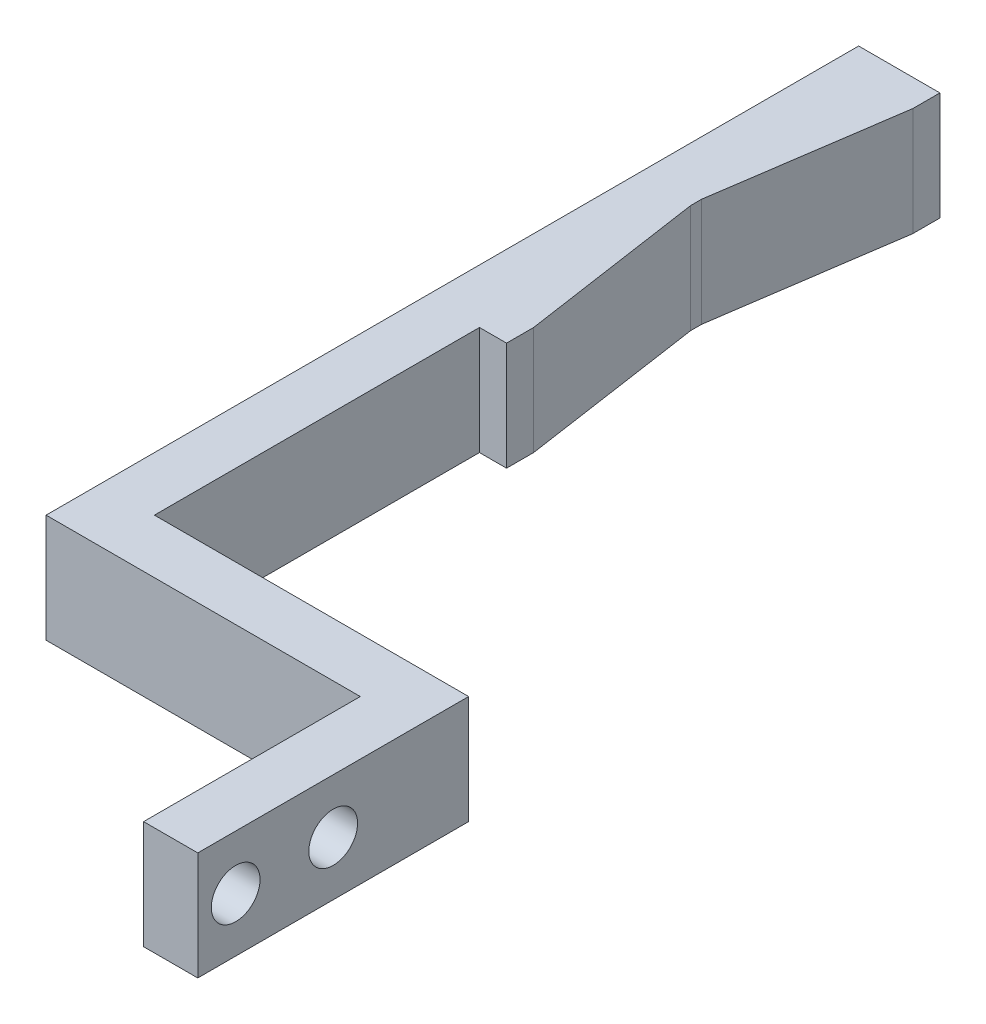
ISO-10303-21;
HEADER;
FILE_DESCRIPTION(('STEP AP214'),'2;1');
FILE_NAME('part.step','',(''),(''),'','','');
FILE_SCHEMA(('AUTOMOTIVE_DESIGN { 1 0 10303 214 1 1 1 1 }'));
ENDSEC;
DATA;
#1=APPLICATION_CONTEXT('core data for automotive mechanical design processes');
#2=APPLICATION_PROTOCOL_DEFINITION('international standard','automotive_design',2000,#1);
#3=PRODUCT_CONTEXT('',#1,'mechanical');
#4=PRODUCT('Part','Part','',(#3));
#5=PRODUCT_RELATED_PRODUCT_CATEGORY('part','',(#4));
#6=PRODUCT_DEFINITION_FORMATION('','',#4);
#7=PRODUCT_DEFINITION_CONTEXT('part definition',#1,'design');
#8=PRODUCT_DEFINITION('design','',#6,#7);
#9=PRODUCT_DEFINITION_SHAPE('','',#8);
#10=(LENGTH_UNIT() NAMED_UNIT(*) SI_UNIT(.MILLI.,.METRE.));
#11=(NAMED_UNIT(*) PLANE_ANGLE_UNIT() SI_UNIT($,.RADIAN.));
#12=(NAMED_UNIT(*) SI_UNIT($,.STERADIAN.) SOLID_ANGLE_UNIT());
#13=UNCERTAINTY_MEASURE_WITH_UNIT(LENGTH_MEASURE(1.E-05),#10,'distance_accuracy_value','');
#14=(GEOMETRIC_REPRESENTATION_CONTEXT(3) GLOBAL_UNCERTAINTY_ASSIGNED_CONTEXT((#13)) GLOBAL_UNIT_ASSIGNED_CONTEXT((#10,
#11,#12)) REPRESENTATION_CONTEXT('',''));
#15=CARTESIAN_POINT('',(0.,0.,0.));
#16=DIRECTION('',(0.,0.,1.));
#17=DIRECTION('',(1.,0.,0.));
#18=AXIS2_PLACEMENT_3D('',#15,#16,#17);
#19=CARTESIAN_POINT('',(-5.,10.,-1.11022302462516E-12));
#20=DIRECTION('',(1.,0.,0.));
#21=DIRECTION('',(0.,0.,-1.));
#22=AXIS2_PLACEMENT_3D('',#19,#20,#21);
#23=PLANE('',#22);
#24=CARTESIAN_POINT('',(-5.00000000000004,5.,-3.50000000000011));
#25=DIRECTION('',(1.,0.,0.));
#26=DIRECTION('',(0.,0.,-1.));
#27=AXIS2_PLACEMENT_3D('',#24,#25,#26);
#28=CIRCLE('',#27,2.25);
#29=CARTESIAN_POINT('',(-5.00000000000004,5.,-5.75000000000011));
#30=VERTEX_POINT('',#29);
#31=EDGE_CURVE('E183',#30,#30,#28,.T.);
#32=ORIENTED_EDGE('',*,*,#31,.T.);
#33=EDGE_LOOP('',(#32));
#34=FACE_BOUND('',#33,.T.);
#35=CARTESIAN_POINT('',(-5.00000000000004,5.,-12.5000000000001));
#36=DIRECTION('',(1.,0.,0.));
#37=DIRECTION('',(0.,0.,-1.));
#38=AXIS2_PLACEMENT_3D('',#35,#36,#37);
#39=CIRCLE('',#38,2.25);
#40=CARTESIAN_POINT('',(-5.00000000000004,5.,-14.7500000000001));
#41=VERTEX_POINT('',#40);
#42=EDGE_CURVE('E339',#41,#41,#39,.T.);
#43=ORIENTED_EDGE('',*,*,#42,.T.);
#44=EDGE_LOOP('',(#43));
#45=FACE_BOUND('',#44,.T.);
#46=DIRECTION('',(0.,0.,1.));
#47=VECTOR('',#46,1.);
#48=CARTESIAN_POINT('',(-5.,0.,0.));
#49=LINE('',#48,#47);
#50=CARTESIAN_POINT('',(-5.00000000000001,5.27355936696949E-13,-20.));
#51=VERTEX_POINT('',#50);
#52=CARTESIAN_POINT('',(-5.,0.,0.));
#53=VERTEX_POINT('',#52);
#54=EDGE_CURVE('E178',#51,#53,#49,.T.);
#55=ORIENTED_EDGE('',*,*,#54,.T.);
#56=DIRECTION('',(0.,-1.,0.));
#57=VECTOR('',#56,1.);
#58=CARTESIAN_POINT('',(-5.,10.,-1.11022302462516E-12));
#59=LINE('',#58,#57);
#60=CARTESIAN_POINT('',(-5.,10.,-1.11022302462516E-12));
#61=VERTEX_POINT('',#60);
#62=EDGE_CURVE('E11',#61,#53,#59,.T.);
#63=ORIENTED_EDGE('',*,*,#62,.F.);
#64=DIRECTION('',(0.,0.,1.));
#65=VECTOR('',#64,1.);
#66=CARTESIAN_POINT('',(-5.,10.,-1.11022302462516E-12));
#67=LINE('',#66,#65);
#68=CARTESIAN_POINT('',(-5.00000000000001,10.0000000000005,-20.0000000000011));
#69=VERTEX_POINT('',#68);
#70=EDGE_CURVE('E223',#69,#61,#67,.T.);
#71=ORIENTED_EDGE('',*,*,#70,.F.);
#72=DIRECTION('',(0.,-1.,0.));
#73=VECTOR('',#72,1.);
#74=CARTESIAN_POINT('',(-5.00000000000001,10.0000000000005,-20.0000000000011));
#75=LINE('',#74,#73);
#76=EDGE_CURVE('E174',#69,#51,#75,.T.);
#77=ORIENTED_EDGE('',*,*,#76,.T.);
#78=EDGE_LOOP('',(#55,#63,#71,#77));
#79=FACE_BOUND('',#78,.T.);
#80=ADVANCED_FACE('F40',(#34,#45,#79),#23,.F.);
#81=CARTESIAN_POINT('',(0.,10.,0.));
#82=DIRECTION('',(0.,0.,-1.));
#83=DIRECTION('',(-1.,0.,0.));
#84=AXIS2_PLACEMENT_3D('',#81,#82,#83);
#85=PLANE('',#84);
#86=DIRECTION('',(1.,0.,0.));
#87=VECTOR('',#86,1.);
#88=CARTESIAN_POINT('',(0.,0.,0.));
#89=LINE('',#88,#87);
#90=CARTESIAN_POINT('',(0.,0.,0.));
#91=VERTEX_POINT('',#90);
#92=EDGE_CURVE('E182',#53,#91,#89,.T.);
#93=ORIENTED_EDGE('',*,*,#92,.T.);
#94=DIRECTION('',(0.,-1.,0.));
#95=VECTOR('',#94,1.);
#96=CARTESIAN_POINT('',(0.,10.,0.));
#97=LINE('',#96,#95);
#98=CARTESIAN_POINT('',(0.,10.,0.));
#99=VERTEX_POINT('',#98);
#100=EDGE_CURVE('E49',#99,#91,#97,.T.);
#101=ORIENTED_EDGE('',*,*,#100,.F.);
#102=DIRECTION('',(1.,0.,0.));
#103=VECTOR('',#102,1.);
#104=CARTESIAN_POINT('',(0.,10.,0.));
#105=LINE('',#104,#103);
#106=EDGE_CURVE('E118',#61,#99,#105,.T.);
#107=ORIENTED_EDGE('',*,*,#106,.F.);
#108=ORIENTED_EDGE('',*,*,#62,.T.);
#109=EDGE_LOOP('',(#93,#101,#107,#108));
#110=FACE_BOUND('',#109,.T.);
#111=ADVANCED_FACE('F329',(#110),#85,.F.);
#112=CARTESIAN_POINT('',(0.,10.,0.));
#113=DIRECTION('',(-1.,0.,0.));
#114=DIRECTION('',(0.,0.,1.));
#115=AXIS2_PLACEMENT_3D('',#112,#113,#114);
#116=PLANE('',#115);
#117=CARTESIAN_POINT('',(0.,5.,-3.50000000000023));
#118=DIRECTION('',(1.,0.,0.));
#119=DIRECTION('',(0.,0.,-1.));
#120=AXIS2_PLACEMENT_3D('',#117,#118,#119);
#121=CIRCLE('',#120,2.25);
#122=CARTESIAN_POINT('',(0.,5.,-5.75000000000023));
#123=VERTEX_POINT('',#122);
#124=EDGE_CURVE('E342',#123,#123,#121,.T.);
#125=ORIENTED_EDGE('',*,*,#124,.F.);
#126=EDGE_LOOP('',(#125));
#127=FACE_BOUND('',#126,.T.);
#128=CARTESIAN_POINT('',(0.,5.,-12.5000000000002));
#129=DIRECTION('',(1.,0.,0.));
#130=DIRECTION('',(0.,0.,-1.));
#131=AXIS2_PLACEMENT_3D('',#128,#129,#130);
#132=CIRCLE('',#131,2.25);
#133=CARTESIAN_POINT('',(0.,5.,-14.7500000000002));
#134=VERTEX_POINT('',#133);
#135=EDGE_CURVE('E349',#134,#134,#132,.T.);
#136=ORIENTED_EDGE('',*,*,#135,.F.);
#137=EDGE_LOOP('',(#136));
#138=FACE_BOUND('',#137,.T.);
#139=DIRECTION('',(0.,0.,-1.));
#140=VECTOR('',#139,1.);
#141=CARTESIAN_POINT('',(0.,0.,0.));
#142=LINE('',#141,#140);
#143=CARTESIAN_POINT('',(-1.11022302462516E-13,3.33066907387547E-13,-25.));
#144=VERTEX_POINT('',#143);
#145=EDGE_CURVE('E186',#91,#144,#142,.T.);
#146=ORIENTED_EDGE('',*,*,#145,.T.);
#147=DIRECTION('',(0.,-1.,0.));
#148=VECTOR('',#147,1.);
#149=CARTESIAN_POINT('',(0.,10.0000000000003,-25.0000000000003));
#150=LINE('',#149,#148);
#151=CARTESIAN_POINT('',(0.,10.0000000000003,-25.0000000000003));
#152=VERTEX_POINT('',#151);
#153=EDGE_CURVE('E252',#152,#144,#150,.T.);
#154=ORIENTED_EDGE('',*,*,#153,.F.);
#155=DIRECTION('',(0.,0.,-1.));
#156=VECTOR('',#155,1.);
#157=CARTESIAN_POINT('',(0.,10.,0.));
#158=LINE('',#157,#156);
#159=EDGE_CURVE('E263',#99,#152,#158,.T.);
#160=ORIENTED_EDGE('',*,*,#159,.F.);
#161=ORIENTED_EDGE('',*,*,#100,.T.);
#162=EDGE_LOOP('',(#146,#154,#160,#161));
#163=FACE_BOUND('',#162,.T.);
#164=ADVANCED_FACE('F261',(#127,#138,#163),#116,.F.);
#165=CARTESIAN_POINT('',(0.,10.0000000000003,-25.0000000000003));
#166=DIRECTION('',(0.,0.,1.));
#167=DIRECTION('',(1.,0.,0.));
#168=AXIS2_PLACEMENT_3D('',#165,#166,#167);
#169=PLANE('',#168);
#170=DIRECTION('',(-1.,0.,0.));
#171=VECTOR('',#170,1.);
#172=CARTESIAN_POINT('',(-1.11022302462516E-13,3.33066907387547E-13,-25.));
#173=LINE('',#172,#171);
#174=CARTESIAN_POINT('',(-29.,3.33066907387547E-13,-25.000000000001));
#175=VERTEX_POINT('',#174);
#176=EDGE_CURVE('E189',#144,#175,#173,.T.);
#177=ORIENTED_EDGE('',*,*,#176,.T.);
#178=DIRECTION('',(0.,-1.,0.));
#179=VECTOR('',#178,1.);
#180=CARTESIAN_POINT('',(-29.,10.0000000000003,-25.));
#181=LINE('',#180,#179);
#182=CARTESIAN_POINT('',(-29.,10.0000000000003,-25.));
#183=VERTEX_POINT('',#182);
#184=EDGE_CURVE('E248',#183,#175,#181,.T.);
#185=ORIENTED_EDGE('',*,*,#184,.F.);
#186=DIRECTION('',(-1.,0.,0.));
#187=VECTOR('',#186,1.);
#188=CARTESIAN_POINT('',(0.,10.0000000000003,-25.0000000000003));
#189=LINE('',#188,#187);
#190=EDGE_CURVE('E282',#152,#183,#189,.T.);
#191=ORIENTED_EDGE('',*,*,#190,.F.);
#192=ORIENTED_EDGE('',*,*,#153,.T.);
#193=EDGE_LOOP('',(#177,#185,#191,#192));
#194=FACE_BOUND('',#193,.T.);
#195=ADVANCED_FACE('F271',(#194),#169,.F.);
#196=CARTESIAN_POINT('',(-29.,10.,-1.11022302462516E-13));
#197=DIRECTION('',(-1.,0.,0.));
#198=DIRECTION('',(0.,0.,1.));
#199=AXIS2_PLACEMENT_3D('',#196,#197,#198);
#200=PLANE('',#199);
#201=DIRECTION('',(0.,0.,-1.));
#202=VECTOR('',#201,1.);
#203=CARTESIAN_POINT('',(-29.,0.,-9.15933995315754E-13));
#204=LINE('',#203,#202);
#205=CARTESIAN_POINT('',(-29.,3.33066907387547E-13,-55.000000000001));
#206=VERTEX_POINT('',#205);
#207=EDGE_CURVE('E192',#175,#206,#204,.T.);
#208=ORIENTED_EDGE('',*,*,#207,.T.);
#209=DIRECTION('',(0.,-1.,0.));
#210=VECTOR('',#209,1.);
#211=CARTESIAN_POINT('',(-29.,10.0000000000003,-55.));
#212=LINE('',#211,#210);
#213=CARTESIAN_POINT('',(-29.,10.0000000000003,-55.));
#214=VERTEX_POINT('',#213);
#215=EDGE_CURVE('E245',#214,#206,#212,.T.);
#216=ORIENTED_EDGE('',*,*,#215,.F.);
#217=DIRECTION('',(0.,0.,-1.));
#218=VECTOR('',#217,1.);
#219=CARTESIAN_POINT('',(-29.,10.,-1.11022302462516E-13));
#220=LINE('',#219,#218);
#221=EDGE_CURVE('E277',#183,#214,#220,.T.);
#222=ORIENTED_EDGE('',*,*,#221,.F.);
#223=ORIENTED_EDGE('',*,*,#184,.T.);
#224=EDGE_LOOP('',(#208,#216,#222,#223));
#225=FACE_BOUND('',#224,.T.);
#226=ADVANCED_FACE('F275',(#225),#200,.F.);
#227=CARTESIAN_POINT('',(0.,10.0000000000003,-55.0000000000004));
#228=DIRECTION('',(0.,0.,1.));
#229=DIRECTION('',(1.,0.,0.));
#230=AXIS2_PLACEMENT_3D('',#227,#228,#229);
#231=PLANE('',#230);
#232=DIRECTION('',(-1.,0.,0.));
#233=VECTOR('',#232,1.);
#234=CARTESIAN_POINT('',(0.,3.33066907387547E-13,-55.));
#235=LINE('',#234,#233);
#236=CARTESIAN_POINT('',(-26.5,5.27355936696949E-13,-55.));
#237=VERTEX_POINT('',#236);
#238=EDGE_CURVE('E196',#237,#206,#235,.T.);
#239=ORIENTED_EDGE('',*,*,#238,.F.);
#240=DIRECTION('',(0.,-1.,0.));
#241=VECTOR('',#240,1.);
#242=CARTESIAN_POINT('',(-26.5,10.0000000000005,-55.));
#243=LINE('',#242,#241);
#244=CARTESIAN_POINT('',(-26.5,10.0000000000005,-55.));
#245=VERTEX_POINT('',#244);
#246=EDGE_CURVE('E242',#245,#237,#243,.T.);
#247=ORIENTED_EDGE('',*,*,#246,.F.);
#248=DIRECTION('',(-1.,0.,0.));
#249=VECTOR('',#248,1.);
#250=CARTESIAN_POINT('',(0.,10.0000000000003,-55.0000000000004));
#251=LINE('',#250,#249);
#252=EDGE_CURVE('E281',#245,#214,#251,.T.);
#253=ORIENTED_EDGE('',*,*,#252,.T.);
#254=ORIENTED_EDGE('',*,*,#215,.T.);
#255=EDGE_LOOP('',(#239,#247,#253,#254));
#256=FACE_BOUND('',#255,.T.);
#257=ADVANCED_FACE('F401',(#256),#231,.T.);
#258=CARTESIAN_POINT('',(-26.5,10.0000000000002,-1.11022302462516E-12));
#259=DIRECTION('',(1.,0.,0.));
#260=DIRECTION('',(0.,0.,-1.));
#261=AXIS2_PLACEMENT_3D('',#258,#259,#260);
#262=PLANE('',#261);
#263=DIRECTION('',(0.,0.,1.));
#264=VECTOR('',#263,1.);
#265=CARTESIAN_POINT('',(-26.5,1.94289029309402E-13,0.));
#266=LINE('',#265,#264);
#267=CARTESIAN_POINT('',(-26.5,1.94289029309402E-13,-57.5));
#268=VERTEX_POINT('',#267);
#269=EDGE_CURVE('E201',#268,#237,#266,.T.);
#270=ORIENTED_EDGE('',*,*,#269,.F.);
#271=DIRECTION('',(0.,-1.,0.));
#272=VECTOR('',#271,1.);
#273=CARTESIAN_POINT('',(-26.5,10.0000000000002,-57.5000000000001));
#274=LINE('',#273,#272);
#275=CARTESIAN_POINT('',(-26.5,10.0000000000002,-57.5000000000001));
#276=VERTEX_POINT('',#275);
#277=EDGE_CURVE('E239',#276,#268,#274,.T.);
#278=ORIENTED_EDGE('',*,*,#277,.F.);
#279=DIRECTION('',(0.,0.,1.));
#280=VECTOR('',#279,1.);
#281=CARTESIAN_POINT('',(-26.5,10.0000000000002,-1.11022302462516E-12));
#282=LINE('',#281,#280);
#283=EDGE_CURVE('E288',#276,#245,#282,.T.);
#284=ORIENTED_EDGE('',*,*,#283,.T.);
#285=ORIENTED_EDGE('',*,*,#246,.T.);
#286=EDGE_LOOP('',(#270,#278,#284,#285));
#287=FACE_BOUND('',#286,.T.);
#288=ADVANCED_FACE('F398',(#287),#262,.T.);
#289=CARTESIAN_POINT('',(-17.6621507197291,10.0000000000003,2.59737510584251));
#290=DIRECTION('',(0.989359135364853,0.,-0.145493990494831));
#291=DIRECTION('',(-0.145493990494831,0.,-0.989359135364853));
#292=AXIS2_PLACEMENT_3D('',#289,#290,#291);
#293=PLANE('',#292);
#294=DIRECTION('',(0.145493990494831,0.,0.989359135364853));
#295=VECTOR('',#294,1.);
#296=CARTESIAN_POINT('',(-17.6621507197291,3.33066907387547E-13,2.59737510584249));
#297=LINE('',#296,#295);
#298=CARTESIAN_POINT('',(-29.,3.33066907387547E-13,-74.4999999999998));
#299=VERTEX_POINT('',#298);
#300=EDGE_CURVE('E205',#299,#268,#297,.T.);
#301=ORIENTED_EDGE('',*,*,#300,.F.);
#302=DIRECTION('',(0.,-1.,0.));
#303=VECTOR('',#302,1.);
#304=CARTESIAN_POINT('',(-29.,10.0000000000003,-74.5));
#305=LINE('',#304,#303);
#306=CARTESIAN_POINT('',(-29.,10.0000000000003,-74.5));
#307=VERTEX_POINT('',#306);
#308=EDGE_CURVE('E236',#307,#299,#305,.T.);
#309=ORIENTED_EDGE('',*,*,#308,.F.);
#310=DIRECTION('',(0.145493990494831,0.,0.989359135364853));
#311=VECTOR('',#310,1.);
#312=CARTESIAN_POINT('',(-17.6621507197291,10.0000000000003,2.59737510584251));
#313=LINE('',#312,#311);
#314=EDGE_CURVE('E293',#307,#276,#313,.T.);
#315=ORIENTED_EDGE('',*,*,#314,.T.);
#316=ORIENTED_EDGE('',*,*,#277,.T.);
#317=EDGE_LOOP('',(#301,#309,#315,#316));
#318=FACE_BOUND('',#317,.T.);
#319=ADVANCED_FACE('F392',(#318),#293,.T.);
#320=CARTESIAN_POINT('',(-29.,5.27355936696949E-13,-75.5));
#321=VERTEX_POINT('',#320);
#322=EDGE_CURVE('E197',#299,#321,#204,.T.);
#323=ORIENTED_EDGE('',*,*,#322,.T.);
#324=DIRECTION('',(0.,-1.,0.));
#325=VECTOR('',#324,1.);
#326=CARTESIAN_POINT('',(-29.,10.0000000000005,-75.5000000000002));
#327=LINE('',#326,#325);
#328=CARTESIAN_POINT('',(-29.,10.0000000000005,-75.5000000000002));
#329=VERTEX_POINT('',#328);
#330=EDGE_CURVE('E233',#329,#321,#327,.T.);
#331=ORIENTED_EDGE('',*,*,#330,.F.);
#332=EDGE_CURVE('E284',#307,#329,#220,.T.);
#333=ORIENTED_EDGE('',*,*,#332,.F.);
#334=ORIENTED_EDGE('',*,*,#308,.T.);
#335=EDGE_LOOP('',(#323,#331,#333,#334));
#336=FACE_BOUND('',#335,.T.);
#337=ADVANCED_FACE('F381',(#336),#200,.F.);
#338=CARTESIAN_POINT('',(-39.2540220152413,10.,-5.77265029635915));
#339=DIRECTION('',(0.989359135364853,0.,0.145493990494832));
#340=DIRECTION('',(0.145493990494832,0.,-0.989359135364853));
#341=AXIS2_PLACEMENT_3D('',#338,#339,#340);
#342=PLANE('',#341);
#343=DIRECTION('',(-0.145493990494832,0.,0.989359135364853));
#344=VECTOR('',#343,1.);
#345=CARTESIAN_POINT('',(-39.2540220152414,0.,-5.77265029635884));
#346=LINE('',#345,#344);
#347=CARTESIAN_POINT('',(-26.5,1.94289029309402E-13,-92.5));
#348=VERTEX_POINT('',#347);
#349=EDGE_CURVE('E209',#348,#321,#346,.T.);
#350=ORIENTED_EDGE('',*,*,#349,.F.);
#351=DIRECTION('',(0.,-1.,0.));
#352=VECTOR('',#351,1.);
#353=CARTESIAN_POINT('',(-26.5,10.0000000000002,-92.5));
#354=LINE('',#353,#352);
#355=CARTESIAN_POINT('',(-26.5,10.0000000000002,-92.5));
#356=VERTEX_POINT('',#355);
#357=EDGE_CURVE('E230',#356,#348,#354,.T.);
#358=ORIENTED_EDGE('',*,*,#357,.F.);
#359=DIRECTION('',(-0.145493990494832,0.,0.989359135364853));
#360=VECTOR('',#359,1.);
#361=CARTESIAN_POINT('',(-39.2540220152413,10.,-5.77265029635915));
#362=LINE('',#361,#360);
#363=EDGE_CURVE('E292',#356,#329,#362,.T.);
#364=ORIENTED_EDGE('',*,*,#363,.T.);
#365=ORIENTED_EDGE('',*,*,#330,.T.);
#366=EDGE_LOOP('',(#350,#358,#364,#365));
#367=FACE_BOUND('',#366,.T.);
#368=ADVANCED_FACE('F384',(#367),#342,.T.);
#369=CARTESIAN_POINT('',(-26.4999999999998,10.0000000000002,-9.99200722162641E-13));
#370=DIRECTION('',(1.,0.,0.));
#371=DIRECTION('',(0.,0.,-1.));
#372=AXIS2_PLACEMENT_3D('',#369,#370,#371);
#373=PLANE('',#372);
#374=DIRECTION('',(0.,0.,1.));
#375=VECTOR('',#374,1.);
#376=CARTESIAN_POINT('',(-26.4999999999998,1.94289029309402E-13,0.));
#377=LINE('',#376,#375);
#378=CARTESIAN_POINT('',(-26.5,0.,-95.));
#379=VERTEX_POINT('',#378);
#380=EDGE_CURVE('E213',#379,#348,#377,.T.);
#381=ORIENTED_EDGE('',*,*,#380,.F.);
#382=DIRECTION('',(0.,-1.,0.));
#383=VECTOR('',#382,1.);
#384=CARTESIAN_POINT('',(-26.5,10.,-95.0000000000001));
#385=LINE('',#384,#383);
#386=CARTESIAN_POINT('',(-26.5,10.,-95.0000000000001));
#387=VERTEX_POINT('',#386);
#388=EDGE_CURVE('E166',#387,#379,#385,.T.);
#389=ORIENTED_EDGE('',*,*,#388,.F.);
#390=DIRECTION('',(0.,0.,1.));
#391=VECTOR('',#390,1.);
#392=CARTESIAN_POINT('',(-26.4999999999998,10.0000000000002,-9.99200722162641E-13));
#393=LINE('',#392,#391);
#394=EDGE_CURVE('E157',#387,#356,#393,.T.);
#395=ORIENTED_EDGE('',*,*,#394,.T.);
#396=ORIENTED_EDGE('',*,*,#357,.T.);
#397=EDGE_LOOP('',(#381,#389,#395,#396));
#398=FACE_BOUND('',#397,.T.);
#399=ADVANCED_FACE('F313',(#398),#373,.T.);
#400=CARTESIAN_POINT('',(0.,9.99999999999982,-95.));
#401=DIRECTION('',(0.,0.,1.));
#402=DIRECTION('',(1.,0.,0.));
#403=AXIS2_PLACEMENT_3D('',#400,#401,#402);
#404=PLANE('',#403);
#405=DIRECTION('',(-1.,0.,0.));
#406=VECTOR('',#405,1.);
#407=CARTESIAN_POINT('',(0.,-1.94289029309402E-13,-95.));
#408=LINE('',#407,#406);
#409=CARTESIAN_POINT('',(-34.,0.,-94.9999999999997));
#410=VERTEX_POINT('',#409);
#411=EDGE_CURVE('E164',#379,#410,#408,.T.);
#412=ORIENTED_EDGE('',*,*,#411,.T.);
#413=DIRECTION('',(0.,-1.,0.));
#414=VECTOR('',#413,1.);
#415=CARTESIAN_POINT('',(-34.,10.,-95.0000000000001));
#416=LINE('',#415,#414);
#417=CARTESIAN_POINT('',(-34.,10.,-95.0000000000001));
#418=VERTEX_POINT('',#417);
#419=EDGE_CURVE('E161',#418,#410,#416,.T.);
#420=ORIENTED_EDGE('',*,*,#419,.F.);
#421=DIRECTION('',(-1.,0.,0.));
#422=VECTOR('',#421,1.);
#423=CARTESIAN_POINT('',(0.,9.99999999999982,-95.));
#424=LINE('',#423,#422);
#425=EDGE_CURVE('E150',#387,#418,#424,.T.);
#426=ORIENTED_EDGE('',*,*,#425,.F.);
#427=ORIENTED_EDGE('',*,*,#388,.T.);
#428=EDGE_LOOP('',(#412,#420,#426,#427));
#429=FACE_BOUND('',#428,.T.);
#430=ADVANCED_FACE('F162',(#429),#404,.F.);
#431=CARTESIAN_POINT('',(-34.,10.0000000000002,-2.22044604925031E-13));
#432=DIRECTION('',(1.,0.,0.));
#433=DIRECTION('',(0.,0.,-1.));
#434=AXIS2_PLACEMENT_3D('',#431,#432,#433);
#435=PLANE('',#434);
#436=DIRECTION('',(0.,0.,1.));
#437=VECTOR('',#436,1.);
#438=CARTESIAN_POINT('',(-34.,1.94289029309402E-13,0.));
#439=LINE('',#438,#437);
#440=CARTESIAN_POINT('',(-34.,5.27355936696949E-13,-20.));
#441=VERTEX_POINT('',#440);
#442=EDGE_CURVE('E104',#410,#441,#439,.T.);
#443=ORIENTED_EDGE('',*,*,#442,.T.);
#444=DIRECTION('',(0.,-1.,0.));
#445=VECTOR('',#444,1.);
#446=CARTESIAN_POINT('',(-34.,10.0000000000005,-20.0000000000002));
#447=LINE('',#446,#445);
#448=CARTESIAN_POINT('',(-34.,10.0000000000005,-20.0000000000002));
#449=VERTEX_POINT('',#448);
#450=EDGE_CURVE('E167',#449,#441,#447,.T.);
#451=ORIENTED_EDGE('',*,*,#450,.F.);
#452=DIRECTION('',(0.,0.,1.));
#453=VECTOR('',#452,1.);
#454=CARTESIAN_POINT('',(-34.,10.0000000000002,-2.22044604925031E-13));
#455=LINE('',#454,#453);
#456=EDGE_CURVE('E154',#418,#449,#455,.T.);
#457=ORIENTED_EDGE('',*,*,#456,.F.);
#458=ORIENTED_EDGE('',*,*,#419,.T.);
#459=EDGE_LOOP('',(#443,#451,#457,#458));
#460=FACE_BOUND('',#459,.T.);
#461=ADVANCED_FACE('F169',(#460),#435,.F.);
#462=CARTESIAN_POINT('',(0.,10.0000000000003,-20.));
#463=DIRECTION('',(0.,0.,-1.));
#464=DIRECTION('',(-1.,0.,0.));
#465=AXIS2_PLACEMENT_3D('',#462,#463,#464);
#466=PLANE('',#465);
#467=DIRECTION('',(1.,0.,0.));
#468=VECTOR('',#467,1.);
#469=CARTESIAN_POINT('',(0.,3.33066907387547E-13,-20.));
#470=LINE('',#469,#468);
#471=EDGE_CURVE('E110',#441,#51,#470,.T.);
#472=ORIENTED_EDGE('',*,*,#471,.T.);
#473=ORIENTED_EDGE('',*,*,#76,.F.);
#474=DIRECTION('',(1.,0.,0.));
#475=VECTOR('',#474,1.);
#476=CARTESIAN_POINT('',(0.,10.0000000000003,-20.));
#477=LINE('',#476,#475);
#478=EDGE_CURVE('E57',#449,#69,#477,.T.);
#479=ORIENTED_EDGE('',*,*,#478,.F.);
#480=ORIENTED_EDGE('',*,*,#450,.T.);
#481=EDGE_LOOP('',(#472,#473,#479,#480));
#482=FACE_BOUND('',#481,.T.);
#483=ADVANCED_FACE('F318',(#482),#466,.F.);
#484=CARTESIAN_POINT('',(0.,10.,0.));
#485=DIRECTION('',(0.,1.,0.));
#486=DIRECTION('',(0.,0.,1.));
#487=AXIS2_PLACEMENT_3D('',#484,#485,#486);
#488=PLANE('',#487);
#489=ORIENTED_EDGE('',*,*,#70,.T.);
#490=ORIENTED_EDGE('',*,*,#106,.T.);
#491=ORIENTED_EDGE('',*,*,#159,.T.);
#492=ORIENTED_EDGE('',*,*,#190,.T.);
#493=ORIENTED_EDGE('',*,*,#221,.T.);
#494=ORIENTED_EDGE('',*,*,#252,.F.);
#495=ORIENTED_EDGE('',*,*,#283,.F.);
#496=ORIENTED_EDGE('',*,*,#314,.F.);
#497=ORIENTED_EDGE('',*,*,#332,.T.);
#498=ORIENTED_EDGE('',*,*,#363,.F.);
#499=ORIENTED_EDGE('',*,*,#394,.F.);
#500=ORIENTED_EDGE('',*,*,#425,.T.);
#501=ORIENTED_EDGE('',*,*,#456,.T.);
#502=ORIENTED_EDGE('',*,*,#478,.T.);
#503=EDGE_LOOP('',(#489,#490,#491,#492,#493,#494,#495,#496,#497,#498,#499,#500,#501,#502));
#504=FACE_BOUND('',#503,.T.);
#505=ADVANCED_FACE('F152',(#504),#488,.T.);
#506=CARTESIAN_POINT('',(0.,0.,0.));
#507=DIRECTION('',(0.,1.,0.));
#508=DIRECTION('',(0.,0.,1.));
#509=AXIS2_PLACEMENT_3D('',#506,#507,#508);
#510=PLANE('',#509);
#511=ORIENTED_EDGE('',*,*,#54,.F.);
#512=ORIENTED_EDGE('',*,*,#471,.F.);
#513=ORIENTED_EDGE('',*,*,#442,.F.);
#514=ORIENTED_EDGE('',*,*,#411,.F.);
#515=ORIENTED_EDGE('',*,*,#380,.T.);
#516=ORIENTED_EDGE('',*,*,#349,.T.);
#517=ORIENTED_EDGE('',*,*,#322,.F.);
#518=ORIENTED_EDGE('',*,*,#300,.T.);
#519=ORIENTED_EDGE('',*,*,#269,.T.);
#520=ORIENTED_EDGE('',*,*,#238,.T.);
#521=ORIENTED_EDGE('',*,*,#207,.F.);
#522=ORIENTED_EDGE('',*,*,#176,.F.);
#523=ORIENTED_EDGE('',*,*,#145,.F.);
#524=ORIENTED_EDGE('',*,*,#92,.F.);
#525=EDGE_LOOP('',(#511,#512,#513,#514,#515,#516,#517,#518,#519,#520,#521,#522,#523,#524));
#526=FACE_BOUND('',#525,.T.);
#527=ADVANCED_FACE('F267',(#526),#510,.F.);
#528=CARTESIAN_POINT('',(-34.,5.0000000000002,-12.5));
#529=DIRECTION('',(1.,0.,0.));
#530=DIRECTION('',(0.,0.,-1.));
#531=AXIS2_PLACEMENT_3D('',#528,#529,#530);
#532=CYLINDRICAL_SURFACE('',#531,2.25);
#533=ORIENTED_EDGE('',*,*,#135,.T.);
#534=EDGE_LOOP('',(#533));
#535=FACE_BOUND('',#534,.T.);
#536=ORIENTED_EDGE('',*,*,#42,.F.);
#537=EDGE_LOOP('',(#536));
#538=FACE_BOUND('',#537,.T.);
#539=ADVANCED_FACE('F420',(#535,#538),#532,.F.);
#540=CARTESIAN_POINT('',(-34.,5.,-3.5));
#541=DIRECTION('',(1.,0.,0.));
#542=DIRECTION('',(0.,0.,-1.));
#543=AXIS2_PLACEMENT_3D('',#540,#541,#542);
#544=CYLINDRICAL_SURFACE('',#543,2.25);
#545=ORIENTED_EDGE('',*,*,#124,.T.);
#546=EDGE_LOOP('',(#545));
#547=FACE_BOUND('',#546,.T.);
#548=ORIENTED_EDGE('',*,*,#31,.F.);
#549=EDGE_LOOP('',(#548));
#550=FACE_BOUND('',#549,.T.);
#551=ADVANCED_FACE('F422',(#547,#550),#544,.F.);
#552=CLOSED_SHELL('',(#80,#111,#164,#195,#226,#257,#288,#319,#337,#368,#399,#430,#461,#483,#505,
#527,#539,#551));
#553=MANIFOLD_SOLID_BREP('B2',#552);
#554=ADVANCED_BREP_SHAPE_REPRESENTATION('',(#18,#553),#14);
#555=SHAPE_DEFINITION_REPRESENTATION(#9,#554);
ENDSEC;
END-ISO-10303-21;
